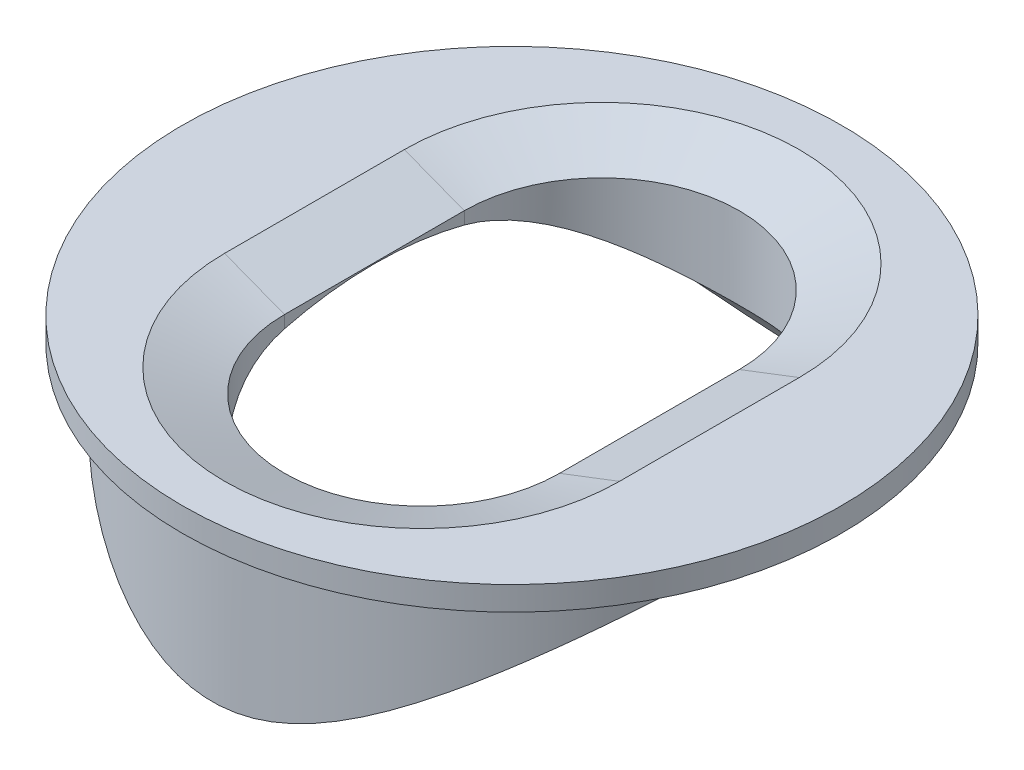
ISO-10303-21;
HEADER;
FILE_DESCRIPTION(('STEP AP214'),'2;1');
FILE_NAME('part.step','',(''),(''),'','','');
FILE_SCHEMA(('AUTOMOTIVE_DESIGN { 1 0 10303 214 1 1 1 1 }'));
ENDSEC;
DATA;
#1=APPLICATION_CONTEXT('core data for automotive mechanical design processes');
#2=APPLICATION_PROTOCOL_DEFINITION('international standard','automotive_design',2000,#1);
#3=PRODUCT_CONTEXT('',#1,'mechanical');
#4=PRODUCT('Part','Part','',(#3));
#5=PRODUCT_RELATED_PRODUCT_CATEGORY('part','',(#4));
#6=PRODUCT_DEFINITION_FORMATION('','',#4);
#7=PRODUCT_DEFINITION_CONTEXT('part definition',#1,'design');
#8=PRODUCT_DEFINITION('design','',#6,#7);
#9=PRODUCT_DEFINITION_SHAPE('','',#8);
#10=(LENGTH_UNIT() NAMED_UNIT(*) SI_UNIT(.MILLI.,.METRE.));
#11=(NAMED_UNIT(*) PLANE_ANGLE_UNIT() SI_UNIT($,.RADIAN.));
#12=(NAMED_UNIT(*) SI_UNIT($,.STERADIAN.) SOLID_ANGLE_UNIT());
#13=UNCERTAINTY_MEASURE_WITH_UNIT(LENGTH_MEASURE(1.E-05),#10,'distance_accuracy_value','');
#14=(GEOMETRIC_REPRESENTATION_CONTEXT(3) GLOBAL_UNCERTAINTY_ASSIGNED_CONTEXT((#13)) GLOBAL_UNIT_ASSIGNED_CONTEXT((#10,
#11,#12)) REPRESENTATION_CONTEXT('',''));
#15=CARTESIAN_POINT('',(0.,0.,0.));
#16=DIRECTION('',(0.,0.,1.));
#17=DIRECTION('',(1.,0.,0.));
#18=AXIS2_PLACEMENT_3D('',#15,#16,#17);
#19=CARTESIAN_POINT('',(0.,5.,0.));
#20=DIRECTION('',(0.,-1.,0.));
#21=DIRECTION('',(0.,0.,-1.));
#22=AXIS2_PLACEMENT_3D('',#19,#20,#21);
#23=CYLINDRICAL_SURFACE('',#22,5.);
#24=CARTESIAN_POINT('',(0.,5.,0.));
#25=DIRECTION('',(0.,1.,0.));
#26=DIRECTION('',(0.,0.,1.));
#27=AXIS2_PLACEMENT_3D('',#24,#25,#26);
#28=CIRCLE('',#27,5.);
#29=CARTESIAN_POINT('',(5.,5.,0.));
#30=VERTEX_POINT('',#29);
#31=CARTESIAN_POINT('',(-5.00000000000002,5.00000000000002,0.));
#32=VERTEX_POINT('',#31);
#33=EDGE_CURVE('E104',#30,#32,#28,.T.);
#34=ORIENTED_EDGE('',*,*,#33,.F.);
#35=CARTESIAN_POINT('',(5.,5.,0.));
#36=CARTESIAN_POINT('',(5.0000064862677,5.00000636279643,-0.118803401095405));
#37=CARTESIAN_POINT('',(4.99576243276274,4.9964675633917,-0.237558182871218));
#38=CARTESIAN_POINT('',(4.97888342242901,4.98241218121961,-0.474087838067091));
#39=CARTESIAN_POINT('',(4.96624750352265,4.97189479839916,-0.591862597565708));
#40=CARTESIAN_POINT('',(4.93280067838579,4.94410935213455,-0.825474733693953));
#41=CARTESIAN_POINT('',(4.9119867768663,4.92683881527392,-0.941311384241482));
#42=CARTESIAN_POINT('',(4.86255145148515,4.88593383048318,-1.17018155731566));
#43=CARTESIAN_POINT('',(4.83392655878944,4.86229655516696,-1.28321381003106));
#44=CARTESIAN_POINT('',(4.73740362240781,4.78287450226039,-1.61550772291657));
#45=CARTESIAN_POINT('',(4.65860789353558,4.71836951829061,-1.82964493287683));
#46=CARTESIAN_POINT('',(4.47594785576944,4.57056793109677,-2.23973970904936));
#47=CARTESIAN_POINT('',(4.37207507698347,4.48726497939233,-2.43569110189251));
#48=CARTESIAN_POINT('',(4.17931765246547,4.33520303254702,-2.7487493551036));
#49=CARTESIAN_POINT('',(4.09605321766379,4.27015451867263,-2.87121824175386));
#50=CARTESIAN_POINT('',(3.92057491487891,4.13495608214751,-3.10654667374618));
#51=CARTESIAN_POINT('',(3.82836116355909,4.06480622600091,-3.21940634431806));
#52=CARTESIAN_POINT('',(3.63553308278675,3.92066908923446,-3.43568816068562));
#53=CARTESIAN_POINT('',(3.53489678957743,3.84667197890407,-3.53908406033977));
#54=CARTESIAN_POINT('',(3.32600704379389,3.69649318853079,-3.73607907111508));
#55=CARTESIAN_POINT('',(3.21775455132494,3.62031178455679,-3.82967941338621));
#56=CARTESIAN_POINT('',(2.99186847524311,3.46590940619064,-4.00872533168449));
#57=CARTESIAN_POINT('',(2.87409893732901,3.38767669457347,-4.09398918746846));
#58=CARTESIAN_POINT('',(2.63097870098595,3.23240914046916,-4.25431125048952));
#59=CARTESIAN_POINT('',(2.50562548412932,3.15537470670733,-4.32936604026974));
#60=CARTESIAN_POINT('',(2.24746866950541,3.0050115613057,-4.46882104937819));
#61=CARTESIAN_POINT('',(2.11468364253878,2.93167441297209,-4.53324636625595));
#62=CARTESIAN_POINT('',(1.84110422364287,2.79155403229088,-4.65107409789267));
#63=CARTESIAN_POINT('',(1.70031678782893,2.72476524134072,-4.70448590476211));
#64=CARTESIAN_POINT('',(1.39667622874439,2.59583630496641,-4.8038705578035));
#65=CARTESIAN_POINT('',(1.23299156369287,2.53471789619366,-4.8486776643058));
#66=CARTESIAN_POINT('',(0.896180811817696,2.43187191424553,-4.92202476595886));
#67=CARTESIAN_POINT('',(0.723078773763431,2.39009732197607,-4.95060424437364));
#68=CARTESIAN_POINT('',(0.457661896369308,2.34688431376343,-4.97982440219376));
#69=CARTESIAN_POINT('',(0.367618679010188,2.33571370000033,-4.98729261982802));
#70=CARTESIAN_POINT('',(0.186635888055952,2.3206515347262,-4.99733565959028));
#71=CARTESIAN_POINT('',(0.095696399075067,2.31675930257913,-4.99991093928053));
#72=CARTESIAN_POINT('',(-0.0861953552895069,2.31649708247112,-5.00008454722765));
#73=CARTESIAN_POINT('',(-0.177147620700307,2.32012711072076,-4.99768286475912));
#74=CARTESIAN_POINT('',(-0.358199787378119,2.33469045716225,-4.98797701095387));
#75=CARTESIAN_POINT('',(-0.448299583463619,2.34562466496004,-4.9806722424497));
#76=CARTESIAN_POINT('',(-0.634290345987522,2.37538324774709,-4.9605577711742));
#77=CARTESIAN_POINT('',(-0.730044329719768,2.3947851529219,-4.94734291419499));
#78=CARTESIAN_POINT('',(-0.919072038911221,2.44038747060614,-4.9157405398429));
#79=CARTESIAN_POINT('',(-1.01234395824117,2.46659269219059,-4.89734936269663));
#80=CARTESIAN_POINT('',(-1.28826795172829,2.55374344299518,-4.83487145070514));
#81=CARTESIAN_POINT('',(-1.46664526370663,2.62315426397916,-4.78352415648848));
#82=CARTESIAN_POINT('',(-1.77568076874676,2.76004871810486,-4.67632227850057));
#83=CARTESIAN_POINT('',(-1.90862269999419,2.82500795712383,-4.62355194613133));
#84=CARTESIAN_POINT('',(-2.16730339944136,2.96043831206373,-4.50808681272012));
#85=CARTESIAN_POINT('',(-2.29303788433664,3.03091264789804,-4.44538619181528));
#86=CARTESIAN_POINT('',(-2.53766285158917,3.17491879023624,-4.31043075762212));
#87=CARTESIAN_POINT('',(-2.65654383781025,3.24845460689311,-4.23816312441515));
#88=CARTESIAN_POINT('',(-2.88743564285202,3.39652708661221,-4.08435401417139));
#89=CARTESIAN_POINT('',(-2.99944783455588,3.47106354601934,-4.00281439970954));
#90=CARTESIAN_POINT('',(-3.22226109628928,3.62342077684068,-3.82600354374306));
#91=CARTESIAN_POINT('',(-3.33269201981388,3.70120929265264,-3.73023700414124));
#92=CARTESIAN_POINT('',(-3.54559939981486,3.85446404087318,-3.52848927170201));
#93=CARTESIAN_POINT('',(-3.64807467199064,3.92992992652313,-3.42250656330085));
#94=CARTESIAN_POINT('',(-3.84425294796649,4.07681645366273,-3.20056123189973));
#95=CARTESIAN_POINT('',(-3.93797365950211,4.14824514018382,-3.08461970676717));
#96=CARTESIAN_POINT('',(-4.11599426421235,4.28566109460446,-2.84274064052496));
#97=CARTESIAN_POINT('',(-4.20029381312783,4.35164816363854,-2.71680273442447));
#98=CARTESIAN_POINT('',(-4.39878554184217,4.50853314592501,-2.38827463214803));
#99=CARTESIAN_POINT('',(-4.50631929530225,4.59498946786027,-2.17932731194452));
#100=CARTESIAN_POINT('',(-4.64613821914312,4.7084038705407,-1.8513717036081));
#101=CARTESIAN_POINT('',(-4.68917312218695,4.74350440601256,-1.73959798407546));
#102=CARTESIAN_POINT('',(-4.76751793421716,4.80764297166477,-1.51170856686385));
#103=CARTESIAN_POINT('',(-4.80283171060456,4.83668403661189,-1.39559507719868));
#104=CARTESIAN_POINT('',(-4.86543453319277,4.88830518104936,-1.15874024023432));
#105=CARTESIAN_POINT('',(-4.89265476556204,4.91082981449133,-1.03796855116843));
#106=CARTESIAN_POINT('',(-4.93816722227972,4.94855722519953,-0.793680719841944));
#107=CARTESIAN_POINT('',(-4.9564638664516,4.96376362711192,-0.670165967971713));
#108=CARTESIAN_POINT('',(-4.98377697031546,4.98648272603519,-0.421443909131275));
#109=CARTESIAN_POINT('',(-4.99279601788868,4.99399756851713,-0.296237084023912));
#110=CARTESIAN_POINT('',(-5.00137053830483,5.00114166173048,-0.0452813606587532));
#111=CARTESIAN_POINT('',(-5.00092704086014,5.00077177047715,0.0804674771283918));
#112=CARTESIAN_POINT('',(-4.9912131909085,4.99267919208227,0.316217699577991));
#113=CARTESIAN_POINT('',(-4.98300958868131,4.98584511760915,0.426296149457824));
#114=CARTESIAN_POINT('',(-4.95942180024422,4.96622340308935,0.645178571447259));
#115=CARTESIAN_POINT('',(-4.94403538382096,4.95343391393135,0.753982136950653));
#116=CARTESIAN_POINT('',(-4.90632392627914,4.922153588973,0.969508932578345));
#117=CARTESIAN_POINT('',(-4.88400108118507,4.90366455762227,1.07623280976896));
#118=CARTESIAN_POINT('',(-4.83274114539643,4.86132925877314,1.28701083316512));
#119=CARTESIAN_POINT('',(-4.80380153552005,4.83748095091222,1.39106394571243));
#120=CARTESIAN_POINT('',(-4.70677908129298,4.75780997966539,1.70100357204864));
#121=CARTESIAN_POINT('',(-4.62897463511253,4.69426548906173,1.90197317990273));
#122=CARTESIAN_POINT('',(-4.45119251532421,4.55070829820292,2.28736622034062));
#123=CARTESIAN_POINT('',(-4.35120664535608,4.47068951124314,2.47178350112441));
#124=CARTESIAN_POINT('',(-4.16241303362757,4.32196402989804,2.77431022087587));
#125=CARTESIAN_POINT('',(-4.07807881363138,4.25618753965956,2.89671891082123));
#126=CARTESIAN_POINT('',(-3.90043631108394,4.11958730343164,3.13182124456801));
#127=CARTESIAN_POINT('',(-3.8071276888363,4.04876336641404,3.24451452031805));
#128=CARTESIAN_POINT('',(-3.61204642318573,3.90332909910819,3.46039828484842));
#129=CARTESIAN_POINT('',(-3.51024916115611,3.82870801884464,3.5635591655786));
#130=CARTESIAN_POINT('',(-3.29899388009149,3.67738428016308,3.75997885952875));
#131=CARTESIAN_POINT('',(-3.18953694443025,3.60068191705467,3.85323906840847));
#132=CARTESIAN_POINT('',(-2.96121350414877,3.44540721169772,4.03144708201688));
#133=CARTESIAN_POINT('',(-2.84221365304651,3.3668259708409,4.11621624228699));
#134=CARTESIAN_POINT('',(-2.59654816531046,3.21106013919063,4.27543853436326));
#135=CARTESIAN_POINT('',(-2.46987979366073,3.13387605960317,4.34988795406829));
#136=CARTESIAN_POINT('',(-2.20902653418021,2.98352281099523,4.48797579821677));
#137=CARTESIAN_POINT('',(-2.07486275313425,2.91034341321279,4.55164272839413));
#138=CARTESIAN_POINT('',(-1.79841659242433,2.77095158572992,4.66777738062599));
#139=CARTESIAN_POINT('',(-1.65614180525609,2.70473280033071,4.72025536508449));
#140=CARTESIAN_POINT('',(-1.35146946258281,2.57850891369613,4.81674752553354));
#141=CARTESIAN_POINT('',(-1.18836978046224,2.51940536010279,4.85976816309609));
#142=CARTESIAN_POINT('',(-0.853057506761583,2.42087013106355,4.92964324178358));
#143=CARTESIAN_POINT('',(-0.680868858020006,2.38138936984465,4.95653805629938));
#144=CARTESIAN_POINT('',(-0.417267118823405,2.34161185607347,4.98335884043903));
#145=CARTESIAN_POINT('',(-0.327939885729355,2.33159299706687,4.9900439743412));
#146=CARTESIAN_POINT('',(-0.148522532583938,2.31874657694375,4.99859875462369));
#147=CARTESIAN_POINT('',(-0.058432477219266,2.31591841207014,5.00046880529626));
#148=CARTESIAN_POINT('',(0.121644228189409,2.31763235091844,4.99933140644563));
#149=CARTESIAN_POINT('',(0.211630875727309,2.32217462964556,4.99632384110741));
#150=CARTESIAN_POINT('',(0.390705731690935,2.33836659549378,4.98551920595953));
#151=CARTESIAN_POINT('',(0.479793444537635,2.3500200062847,4.97771962684741));
#152=CARTESIAN_POINT('',(0.665670000297211,2.38139896959306,4.95646386284238));
#153=CARTESIAN_POINT('',(0.762277582327926,2.40184751901396,4.94249693749092));
#154=CARTESIAN_POINT('',(0.952897655384549,2.44956299936088,4.90931375512976));
#155=CARTESIAN_POINT('',(1.0469082017716,2.47683489368278,4.89009367595844));
#156=CARTESIAN_POINT('',(1.32490519247802,2.56715037769762,4.82502893529808));
#157=CARTESIAN_POINT('',(1.50447425917309,2.6386203494625,4.77182601328659));
#158=CARTESIAN_POINT('',(1.81560530153227,2.77905708413608,4.66101333620414));
#159=CARTESIAN_POINT('',(1.94948557461559,2.84555788327452,4.60651894445034));
#160=CARTESIAN_POINT('',(2.2098947178368,2.98390215298828,4.48741065580201));
#161=CARTESIAN_POINT('',(2.33641925480245,3.05574871700043,4.42279087534715));
#162=CARTESIAN_POINT('',(2.5824750393764,3.20230923095867,4.28378589016389));
#163=CARTESIAN_POINT('',(2.70199665984665,3.27702690475068,4.20938767793865));
#164=CARTESIAN_POINT('',(2.93399936330057,3.42725084654705,4.05109347216149));
#165=CARTESIAN_POINT('',(3.0464818589428,3.50275695275141,3.96719939385687));
#166=CARTESIAN_POINT('',(3.26970299172246,3.65661946215908,3.7855972859226));
#167=CARTESIAN_POINT('',(3.38008420704471,3.73493356113398,3.6874129720634));
#168=CARTESIAN_POINT('',(3.59266286414693,3.88895347699911,3.48062708656673));
#169=CARTESIAN_POINT('',(3.69485901563602,3.96465888158806,3.37202387840541));
#170=CARTESIAN_POINT('',(3.89018127821457,4.11169145947056,3.14465963115798));
#171=CARTESIAN_POINT('',(3.98332637820863,4.1830276775675,3.02592088507467));
#172=CARTESIAN_POINT('',(4.15984718243081,4.31988980472138,2.77827797167402));
#173=CARTESIAN_POINT('',(4.24322187964873,4.38541511469401,2.64937275881185));
#174=CARTESIAN_POINT('',(4.43658392581488,4.53880075702302,2.31715775505749));
#175=CARTESIAN_POINT('',(4.54010823809411,4.62226392609454,2.1078590133521));
#176=CARTESIAN_POINT('',(4.67390583373137,4.73103285742108,1.78004652854697));
#177=CARTESIAN_POINT('',(4.71491832045558,4.7645471565668,1.66848545194811));
#178=CARTESIAN_POINT('',(4.78927419077675,4.82552080229896,1.44122911865483));
#179=CARTESIAN_POINT('',(4.8226186393853,4.85298098971731,1.3255344386574));
#180=CARTESIAN_POINT('',(4.90034346391484,4.91714489125081,1.01333234603958));
#181=CARTESIAN_POINT('',(4.93754678243697,4.94804013902009,0.813745597053209));
#182=CARTESIAN_POINT('',(4.98736819813601,4.98946116455115,0.409390797411382));
#183=CARTESIAN_POINT('',(4.99998882825427,4.99998904091734,0.204623282772272));
#184=CARTESIAN_POINT('',(5.,5.,0.));
#185=B_SPLINE_CURVE_WITH_KNOTS('',3,(#35,#36,#37,#38,#39,#40,#41,#42,#43,#44,#45,#46,#47,#48,
#49,#50,#51,#52,#53,#54,#55,#56,#57,#58,#59,#60,#61,#62,#63,#64,#65,#66,#67,#68,#69,#70,#71,#72,
#73,#74,#75,#76,#77,#78,#79,#80,#81,#82,#83,#84,#85,#86,#87,#88,#89,#90,#91,#92,#93,#94,#95,#96,
#97,#98,#99,#100,#101,#102,#103,#104,#105,#106,#107,#108,#109,#110,#111,#112,#113,#114,#115,
#116,#117,#118,#119,#120,#121,#122,#123,#124,#125,#126,#127,#128,#129,#130,#131,#132,#133,#134,
#135,#136,#137,#138,#139,#140,#141,#142,#143,#144,#145,#146,#147,#148,#149,#150,#151,#152,#153,
#154,#155,#156,#157,#158,#159,#160,#161,#162,#163,#164,#165,#166,#167,#168,#169,#170,#171,#172,
#173,#174,#175,#176,#177,#178,#179,#180,#181,#182,#183,#184),.UNSPECIFIED.,.T.,.F.,(4,2,2,2,2,2,
2,2,2,2,2,2,2,2,2,2,2,2,2,2,2,2,2,2,2,2,2,2,2,2,2,2,2,2,2,2,2,2,2,2,2,2,2,2,2,2,2,2,2,2,2,2,2,2,
2,2,2,2,2,2,2,2,2,2,2,2,2,2,2,2,2,2,2,2,4),(0.,0.356198531128419,0.712437905356867,
1.06880787854775,1.42533637270188,2.13333209783898,2.84156728725027,3.32622201622343,
3.81087042808177,4.29682459639559,4.78271761425373,5.27755036039961,5.77254834493272,
6.26636031071477,6.75974940543413,7.29936255278482,7.83765708456692,8.11040822806103,
8.38313386402394,8.65586008771504,8.92861953390792,9.22392701856221,9.51944381892724,
10.1116379066242,10.5823769120489,11.0533928323055,11.5250464324407,11.9966054526408,
12.4928422896337,12.9891528567514,13.484436760364,13.9797387562551,14.7274446962693,
15.1015034988401,15.4753745093337,15.8523389140401,16.2291164194433,16.6057887984766,
16.9824201883012,17.3138076935885,17.6452981608744,17.9766837873554,18.3081957920453,
18.9794342536,19.6509211619365,20.1379627282136,20.6250227371037,21.1135480143903,
21.6020043344423,22.0992028034935,22.5965796576366,23.0926203414622,23.5882040850607,
24.1228614856737,24.6561746412001,24.9262177314022,25.196238147046,25.4662649741992,
25.7364333195518,26.0351569724179,26.3340985560114,26.9331443359533,27.4099325615984,
27.8869988690867,28.3647063284082,28.8423176087132,29.3434029116174,29.844567050611,
30.3446559675372,30.8447963820892,31.5852621624669,31.9553671316834,32.325420666041,
32.9389891607904,33.5524944315665),.UNSPECIFIED.);
#186=EDGE_CURVE('E116',#30,#32,#185,.T.);
#187=ORIENTED_EDGE('',*,*,#186,.T.);
#188=EDGE_LOOP('',(#34,#187));
#189=FACE_BOUND('',#188,.T.);
#190=ADVANCED_FACE('F33',(#189),#23,.T.);
#191=EDGE_CURVE('E123',#32,#30,#28,.T.);
#192=ORIENTED_EDGE('',*,*,#191,.F.);
#193=EDGE_CURVE('E174',#32,#30,#185,.T.);
#194=ORIENTED_EDGE('',*,*,#193,.T.);
#195=EDGE_LOOP('',(#192,#194));
#196=FACE_BOUND('',#195,.T.);
#197=ADVANCED_FACE('F186',(#196),#23,.T.);
#198=CARTESIAN_POINT('',(0.,5.,0.));
#199=DIRECTION('',(0.,1.,0.));
#200=DIRECTION('',(0.,0.,1.));
#201=AXIS2_PLACEMENT_3D('',#198,#199,#200);
#202=PLANE('',#201);
#203=ORIENTED_EDGE('',*,*,#33,.T.);
#204=ORIENTED_EDGE('',*,*,#191,.T.);
#205=EDGE_LOOP('',(#203,#204));
#206=FACE_BOUND('',#205,.T.);
#207=CARTESIAN_POINT('',(0.,5.,0.));
#208=DIRECTION('',(0.,1.,0.));
#209=DIRECTION('',(0.,0.,1.));
#210=AXIS2_PLACEMENT_3D('',#207,#208,#209);
#211=CIRCLE('',#210,5.5);
#212=CARTESIAN_POINT('',(0.,5.,5.5));
#213=VERTEX_POINT('',#212);
#214=EDGE_CURVE('E124',#213,#213,#211,.T.);
#215=ORIENTED_EDGE('',*,*,#214,.F.);
#216=EDGE_LOOP('',(#215));
#217=FACE_BOUND('',#216,.T.);
#218=ADVANCED_FACE('F210',(#206,#217),#202,.F.);
#219=CARTESIAN_POINT('',(0.,5.4,0.));
#220=DIRECTION('',(0.,-1.,0.));
#221=DIRECTION('',(0.,0.,-1.));
#222=AXIS2_PLACEMENT_3D('',#219,#220,#221);
#223=CYLINDRICAL_SURFACE('',#222,5.5);
#224=CARTESIAN_POINT('',(0.,5.4,0.));
#225=DIRECTION('',(0.,1.,0.));
#226=DIRECTION('',(0.,0.,1.));
#227=AXIS2_PLACEMENT_3D('',#224,#225,#226);
#228=CIRCLE('',#227,5.5);
#229=CARTESIAN_POINT('',(0.,5.4,5.5));
#230=VERTEX_POINT('',#229);
#231=EDGE_CURVE('E120',#230,#230,#228,.T.);
#232=ORIENTED_EDGE('',*,*,#231,.F.);
#233=EDGE_LOOP('',(#232));
#234=FACE_BOUND('',#233,.T.);
#235=ORIENTED_EDGE('',*,*,#214,.T.);
#236=EDGE_LOOP('',(#235));
#237=FACE_BOUND('',#236,.T.);
#238=ADVANCED_FACE('F209',(#234,#237),#223,.T.);
#239=CARTESIAN_POINT('',(0.,5.4,0.));
#240=DIRECTION('',(0.,1.,0.));
#241=DIRECTION('',(0.,0.,1.));
#242=AXIS2_PLACEMENT_3D('',#239,#240,#241);
#243=PLANE('',#242);
#244=DIRECTION('',(0.,0.,-1.));
#245=VECTOR('',#244,1.);
#246=CARTESIAN_POINT('',(-3.29525037907765,5.4,-1.5));
#247=LINE('',#246,#245);
#248=CARTESIAN_POINT('',(-3.29525037907765,5.4,1.5));
#249=VERTEX_POINT('',#248);
#250=CARTESIAN_POINT('',(-3.29525037907765,5.4,-1.5));
#251=VERTEX_POINT('',#250);
#252=EDGE_CURVE('E135',#249,#251,#247,.T.);
#253=ORIENTED_EDGE('',*,*,#252,.T.);
#254=CARTESIAN_POINT('',(0.,5.4,-1.5));
#255=DIRECTION('',(0.,1.,0.));
#256=DIRECTION('',(0.,0.,1.));
#257=AXIS2_PLACEMENT_3D('',#254,#255,#256);
#258=CIRCLE('',#257,3.29525037907765);
#259=CARTESIAN_POINT('',(3.29525037907765,5.4,-1.5));
#260=VERTEX_POINT('',#259);
#261=EDGE_CURVE('E137',#251,#260,#258,.F.);
#262=ORIENTED_EDGE('',*,*,#261,.T.);
#263=DIRECTION('',(0.,0.,1.));
#264=VECTOR('',#263,1.);
#265=CARTESIAN_POINT('',(3.29525037907765,5.4,1.5));
#266=LINE('',#265,#264);
#267=CARTESIAN_POINT('',(3.29525037907765,5.4,1.5));
#268=VERTEX_POINT('',#267);
#269=EDGE_CURVE('E133',#260,#268,#266,.T.);
#270=ORIENTED_EDGE('',*,*,#269,.T.);
#271=CARTESIAN_POINT('',(0.,5.4,1.5));
#272=DIRECTION('',(0.,1.,0.));
#273=DIRECTION('',(0.,0.,1.));
#274=AXIS2_PLACEMENT_3D('',#271,#272,#273);
#275=CIRCLE('',#274,3.29525037907765);
#276=EDGE_CURVE('E131',#268,#249,#275,.F.);
#277=ORIENTED_EDGE('',*,*,#276,.T.);
#278=EDGE_LOOP('',(#253,#262,#270,#277));
#279=FACE_BOUND('',#278,.T.);
#280=ORIENTED_EDGE('',*,*,#231,.T.);
#281=EDGE_LOOP('',(#280));
#282=FACE_BOUND('',#281,.T.);
#283=ADVANCED_FACE('F160',(#279,#282),#243,.T.);
#284=CARTESIAN_POINT('',(0.,0.,-1.5));
#285=DIRECTION('',(0.,1.,0.));
#286=DIRECTION('',(0.,0.,1.));
#287=AXIS2_PLACEMENT_3D('',#284,#285,#286);
#288=CYLINDRICAL_SURFACE('',#287,2.29525037907763);
#289=DIRECTION('',(0.,1.,0.));
#290=VECTOR('',#289,1.);
#291=CARTESIAN_POINT('',(2.29525037907763,0.,-1.5));
#292=LINE('',#291,#290);
#293=CARTESIAN_POINT('',(2.29525037907763,4.80947501931113,-1.5));
#294=VERTEX_POINT('',#293);
#295=CARTESIAN_POINT('',(2.29525037907763,5.01613596496458,-1.5));
#296=VERTEX_POINT('',#295);
#297=EDGE_CURVE('E114',#294,#296,#292,.T.);
#298=ORIENTED_EDGE('',*,*,#297,.T.);
#299=CARTESIAN_POINT('',(0.,5.01613596496458,-1.5));
#300=DIRECTION('',(0.,1.,0.));
#301=DIRECTION('',(0.,0.,1.));
#302=AXIS2_PLACEMENT_3D('',#299,#300,#301);
#303=CIRCLE('',#302,2.29525037907763);
#304=CARTESIAN_POINT('',(-2.29525037907763,5.01613596496458,-1.5));
#305=VERTEX_POINT('',#304);
#306=EDGE_CURVE('E103',#296,#305,#303,.T.);
#307=ORIENTED_EDGE('',*,*,#306,.T.);
#308=DIRECTION('',(0.,1.,0.));
#309=VECTOR('',#308,1.);
#310=CARTESIAN_POINT('',(-2.29525037907763,0.,-1.5));
#311=LINE('',#310,#309);
#312=CARTESIAN_POINT('',(-2.29525037907763,4.80947501931113,-1.5));
#313=VERTEX_POINT('',#312);
#314=EDGE_CURVE('E112',#313,#305,#311,.T.);
#315=ORIENTED_EDGE('',*,*,#314,.F.);
#316=CARTESIAN_POINT('',(-2.29525037907763,4.80947501931113,-1.5));
#317=CARTESIAN_POINT('',(-2.29525756117897,4.79216943666611,-1.56706870523049));
#318=CARTESIAN_POINT('',(-2.29231125221883,4.77368627245705,-1.63381280633951));
#319=CARTESIAN_POINT('',(-2.28073423681691,4.73458929481462,-1.76612741640136));
#320=CARTESIAN_POINT('',(-2.27210741739109,4.71397694644894,-1.83169869639076));
#321=CARTESIAN_POINT('',(-2.24944669337928,4.67092696848744,-1.96092083119155));
#322=CARTESIAN_POINT('',(-2.23543932804101,4.6484987176624,-2.02457948382594));
#323=CARTESIAN_POINT('',(-2.20227028880376,4.6019954806311,-2.14991213750758));
#324=CARTESIAN_POINT('',(-2.18310780016612,4.57792023457526,-2.21158582311525));
#325=CARTESIAN_POINT('',(-2.11837550360657,4.50377414317691,-2.39278329338229));
#326=CARTESIAN_POINT('',(-2.06547974383908,4.45163159344131,-2.50893138624011));
#327=CARTESIAN_POINT('',(-1.94197426450413,4.34434633977588,-2.73004377116025));
#328=CARTESIAN_POINT('',(-1.87133140099418,4.28919817526171,-2.83498660815289));
#329=CARTESIAN_POINT('',(-1.70688356129,4.17393552292586,-3.04063494397144));
#330=CARTESIAN_POINT('',(-1.61158320892234,4.11381292070827,-3.14014601850042));
#331=CARTESIAN_POINT('',(-1.4032613265497,3.99788096813652,-3.3215601612981));
#332=CARTESIAN_POINT('',(-1.29025583764929,3.94206778106477,-3.40347901063474));
#333=CARTESIAN_POINT('',(-1.07384589514597,3.85106293145875,-3.53157178849191));
#334=CARTESIAN_POINT('',(-0.973534627180665,3.81401199842372,-3.5816430492916));
#335=CARTESIAN_POINT('',(-0.764108636516284,3.74910499525985,-3.66727365528827));
#336=CARTESIAN_POINT('',(-0.655003453264526,3.72123912408997,-3.70284847874213));
#337=CARTESIAN_POINT('',(-0.429277591920363,3.67766050951745,-3.75776050014919));
#338=CARTESIAN_POINT('',(-0.312599355061834,3.66205658138367,-3.77695243913229));
#339=CARTESIAN_POINT('',(-0.076666780882392,3.64573757600813,-3.79701401710469));
#340=CARTESIAN_POINT('',(0.0425853212511539,3.64501006247763,-3.79789896026504));
#341=CARTESIAN_POINT('',(0.262508826241921,3.65756321102131,-3.78247992037646));
#342=CARTESIAN_POINT('',(0.363472600736779,3.66892389878316,-3.76853201637913));
#343=CARTESIAN_POINT('',(0.561153008821979,3.70144077228381,-3.7278848567597));
#344=CARTESIAN_POINT('',(0.657867818883834,3.72260111963771,-3.70118018357684));
#345=CARTESIAN_POINT('',(0.848849500879238,3.7737331215167,-3.63500666209038));
#346=CARTESIAN_POINT('',(0.942868833389495,3.80401976943829,-3.59507535125195));
#347=CARTESIAN_POINT('',(1.12308813055019,3.87066326103045,-3.50425618484275));
#348=CARTESIAN_POINT('',(1.20928518786145,3.9070223475252,-3.45336427901387));
#349=CARTESIAN_POINT('',(1.38974986456147,3.99138640585682,-3.33056413834221));
#350=CARTESIAN_POINT('',(1.48213595643693,4.04026086395589,-3.25648729260732));
#351=CARTESIAN_POINT('',(1.65387824607878,4.14050097958669,-3.09584207255562));
#352=CARTESIAN_POINT('',(1.73321906621849,4.19186948602701,-3.00925917880406));
#353=CARTESIAN_POINT('',(1.89023729911333,4.30317508382529,-2.80919035364145));
#354=CARTESIAN_POINT('',(1.96532357492268,4.36307949062689,-2.69363453833082));
#355=CARTESIAN_POINT('',(2.09417371766223,4.47886679005678,-2.44953578014428));
#356=CARTESIAN_POINT('',(2.14796679970723,4.53475510609003,-2.32101093746589));
#357=CARTESIAN_POINT('',(2.22414305635667,4.62978281792166,-2.07828348465601));
#358=CARTESIAN_POINT('',(2.25048442427415,4.67011186385479,-1.96579688937876));
#359=CARTESIAN_POINT('',(2.27715494282705,4.72599901454957,-1.79349099158604));
#360=CARTESIAN_POINT('',(2.28390530619047,4.74388429472149,-1.73536744169404));
#361=CARTESIAN_POINT('',(2.29295509046322,4.77797502665553,-1.6182511699115));
#362=CARTESIAN_POINT('',(2.29525186849171,4.79417947557111,-1.55925795284396));
#363=CARTESIAN_POINT('',(2.29525037907763,4.80947501931113,-1.5));
#364=B_SPLINE_CURVE_WITH_KNOTS('',3,(#316,#317,#318,#319,#320,#321,#322,#323,#324,#325,#326,
#327,#328,#329,#330,#331,#332,#333,#334,#335,#336,#337,#338,#339,#340,#341,#342,#343,#344,#345,
#346,#347,#348,#349,#350,#351,#352,#353,#354,#355,#356,#357,#358,#359,#360,#361,#362,#363),
.UNSPECIFIED.,.F.,.F.,(4,2,2,2,2,2,2,2,2,2,2,2,2,2,2,2,2,2,2,2,2,2,2,4),(0.,0.207692676264016,
0.415243381664593,0.621783234183211,0.828355748376737,1.24007894178027,1.6525768483269,
2.1015352531209,2.55008922270512,2.90297025365333,3.25547350999001,3.61107070410262,
3.96637061621147,4.27262110579314,4.57900176999894,4.89748284816239,5.21608181687993,
5.59897338362119,5.98231311222865,6.43102652570002,6.8791221345173,7.24476857842712,
7.42815732359866,7.61165486346317),.UNSPECIFIED.);
#365=EDGE_CURVE('E101',#313,#294,#364,.T.);
#366=ORIENTED_EDGE('',*,*,#365,.T.);
#367=EDGE_LOOP('',(#298,#307,#315,#366));
#368=FACE_BOUND('',#367,.T.);
#369=ADVANCED_FACE('F170',(#368),#288,.F.);
#370=CARTESIAN_POINT('',(2.29525037907763,0.,-1.5));
#371=DIRECTION('',(1.,0.,0.));
#372=DIRECTION('',(0.,0.,-1.));
#373=AXIS2_PLACEMENT_3D('',#370,#371,#372);
#374=PLANE('',#373);
#375=DIRECTION('',(0.,1.,0.));
#376=VECTOR('',#375,1.);
#377=CARTESIAN_POINT('',(2.29525037907763,0.,1.5));
#378=LINE('',#377,#376);
#379=CARTESIAN_POINT('',(2.29525037907763,4.80947501931113,1.5));
#380=VERTEX_POINT('',#379);
#381=CARTESIAN_POINT('',(2.29525037907763,5.01613596496458,1.5));
#382=VERTEX_POINT('',#381);
#383=EDGE_CURVE('E108',#380,#382,#378,.T.);
#384=ORIENTED_EDGE('',*,*,#383,.T.);
#385=DIRECTION('',(0.,0.,-1.));
#386=VECTOR('',#385,1.);
#387=CARTESIAN_POINT('',(2.29525037907763,5.01613596496458,-1.5));
#388=LINE('',#387,#386);
#389=EDGE_CURVE('E42',#382,#296,#388,.T.);
#390=ORIENTED_EDGE('',*,*,#389,.T.);
#391=ORIENTED_EDGE('',*,*,#297,.F.);
#392=CARTESIAN_POINT('',(2.29525037907763,-1.,0.));
#393=DIRECTION('',(1.,0.,0.));
#394=DIRECTION('',(0.,0.,-1.));
#395=AXIS2_PLACEMENT_3D('',#392,#393,#394);
#396=CIRCLE('',#395,6.);
#397=EDGE_CURVE('E109',#294,#380,#396,.T.);
#398=ORIENTED_EDGE('',*,*,#397,.T.);
#399=EDGE_LOOP('',(#384,#390,#391,#398));
#400=FACE_BOUND('',#399,.T.);
#401=ADVANCED_FACE('F193',(#400),#374,.F.);
#402=CARTESIAN_POINT('',(0.,0.,1.5));
#403=DIRECTION('',(0.,1.,0.));
#404=DIRECTION('',(0.,0.,1.));
#405=AXIS2_PLACEMENT_3D('',#402,#403,#404);
#406=CYLINDRICAL_SURFACE('',#405,2.29525037907763);
#407=DIRECTION('',(0.,1.,0.));
#408=VECTOR('',#407,1.);
#409=CARTESIAN_POINT('',(-2.29525037907763,0.,1.5));
#410=LINE('',#409,#408);
#411=CARTESIAN_POINT('',(-2.29525037907763,4.80947501931113,1.5));
#412=VERTEX_POINT('',#411);
#413=CARTESIAN_POINT('',(-2.29525037907763,5.01613596496458,1.5));
#414=VERTEX_POINT('',#413);
#415=EDGE_CURVE('E107',#412,#414,#410,.T.);
#416=ORIENTED_EDGE('',*,*,#415,.T.);
#417=CARTESIAN_POINT('',(0.,5.01613596496458,1.5));
#418=DIRECTION('',(0.,1.,0.));
#419=DIRECTION('',(0.,0.,1.));
#420=AXIS2_PLACEMENT_3D('',#417,#418,#419);
#421=CIRCLE('',#420,2.29525037907763);
#422=EDGE_CURVE('E11',#414,#382,#421,.T.);
#423=ORIENTED_EDGE('',*,*,#422,.T.);
#424=ORIENTED_EDGE('',*,*,#383,.F.);
#425=CARTESIAN_POINT('',(2.29525037907763,4.80947501931113,1.5));
#426=CARTESIAN_POINT('',(2.29525756117897,4.79216943666611,1.56706870523049));
#427=CARTESIAN_POINT('',(2.29231125221883,4.77368627245705,1.63381280633951));
#428=CARTESIAN_POINT('',(2.28073423681691,4.73458929481462,1.76612741640136));
#429=CARTESIAN_POINT('',(2.27210741739109,4.71397694644894,1.83169869639076));
#430=CARTESIAN_POINT('',(2.24944669337928,4.67092696848744,1.96092083119155));
#431=CARTESIAN_POINT('',(2.23543932804101,4.6484987176624,2.02457948382594));
#432=CARTESIAN_POINT('',(2.20227028880376,4.6019954806311,2.14991213750758));
#433=CARTESIAN_POINT('',(2.18310780016612,4.57792023457526,2.21158582311525));
#434=CARTESIAN_POINT('',(2.11837550360657,4.50377414317691,2.39278329338229));
#435=CARTESIAN_POINT('',(2.06547974383908,4.45163159344131,2.50893138624011));
#436=CARTESIAN_POINT('',(1.94197426450413,4.34434633977588,2.73004377116025));
#437=CARTESIAN_POINT('',(1.87133140099418,4.28919817526171,2.83498660815289));
#438=CARTESIAN_POINT('',(1.70688356129,4.17393552292586,3.04063494397144));
#439=CARTESIAN_POINT('',(1.61158320892234,4.11381292070827,3.14014601850042));
#440=CARTESIAN_POINT('',(1.4032613265497,3.99788096813652,3.3215601612981));
#441=CARTESIAN_POINT('',(1.29025583764929,3.94206778106477,3.40347901063474));
#442=CARTESIAN_POINT('',(1.07384589514597,3.85106293145875,3.53157178849191));
#443=CARTESIAN_POINT('',(0.973534627180664,3.81401199842372,3.5816430492916));
#444=CARTESIAN_POINT('',(0.764108636516283,3.74910499525985,3.66727365528827));
#445=CARTESIAN_POINT('',(0.655003453264525,3.72123912408997,3.70284847874213));
#446=CARTESIAN_POINT('',(0.429277591920362,3.67766050951745,3.75776050014919));
#447=CARTESIAN_POINT('',(0.312599355061833,3.66205658138367,3.77695243913229));
#448=CARTESIAN_POINT('',(0.0766667808823914,3.64573757600813,3.79701401710469));
#449=CARTESIAN_POINT('',(-0.0425853212511545,3.64501006247763,3.79789896026504));
#450=CARTESIAN_POINT('',(-0.262508826241922,3.65756321102131,3.78247992037646));
#451=CARTESIAN_POINT('',(-0.363472600736779,3.66892389878316,3.76853201637913));
#452=CARTESIAN_POINT('',(-0.561153008821979,3.70144077228381,3.7278848567597));
#453=CARTESIAN_POINT('',(-0.657867818883834,3.72260111963771,3.70118018357684));
#454=CARTESIAN_POINT('',(-0.848849500879238,3.7737331215167,3.63500666209038));
#455=CARTESIAN_POINT('',(-0.942868833389495,3.80401976943829,3.59507535125195));
#456=CARTESIAN_POINT('',(-1.12308813055019,3.87066326103045,3.50425618484275));
#457=CARTESIAN_POINT('',(-1.20928518786145,3.9070223475252,3.45336427901387));
#458=CARTESIAN_POINT('',(-1.38974986456147,3.99138640585682,3.33056413834221));
#459=CARTESIAN_POINT('',(-1.48213595643693,4.04026086395589,3.25648729260732));
#460=CARTESIAN_POINT('',(-1.65387824607878,4.14050097958669,3.09584207255562));
#461=CARTESIAN_POINT('',(-1.73321906621849,4.19186948602701,3.00925917880406));
#462=CARTESIAN_POINT('',(-1.89023729911333,4.30317508382529,2.80919035364145));
#463=CARTESIAN_POINT('',(-1.96532357492268,4.36307949062689,2.69363453833082));
#464=CARTESIAN_POINT('',(-2.09417371766223,4.47886679005678,2.44953578014427));
#465=CARTESIAN_POINT('',(-2.14796679970723,4.53475510609003,2.32101093746589));
#466=CARTESIAN_POINT('',(-2.22414305635667,4.62978281792166,2.07828348465601));
#467=CARTESIAN_POINT('',(-2.25048442427415,4.67011186385479,1.96579688937876));
#468=CARTESIAN_POINT('',(-2.27715494282705,4.72599901454957,1.79349099158604));
#469=CARTESIAN_POINT('',(-2.28390530619047,4.74388429472149,1.73536744169404));
#470=CARTESIAN_POINT('',(-2.29295509046322,4.77797502665553,1.6182511699115));
#471=CARTESIAN_POINT('',(-2.29525186849171,4.79417947557111,1.55925795284395));
#472=CARTESIAN_POINT('',(-2.29525037907763,4.80947501931113,1.5));
#473=B_SPLINE_CURVE_WITH_KNOTS('',3,(#425,#426,#427,#428,#429,#430,#431,#432,#433,#434,#435,
#436,#437,#438,#439,#440,#441,#442,#443,#444,#445,#446,#447,#448,#449,#450,#451,#452,#453,#454,
#455,#456,#457,#458,#459,#460,#461,#462,#463,#464,#465,#466,#467,#468,#469,#470,#471,#472),
.UNSPECIFIED.,.F.,.F.,(4,2,2,2,2,2,2,2,2,2,2,2,2,2,2,2,2,2,2,2,2,2,2,4),(0.,0.207692676264016,
0.415243381664593,0.621783234183211,0.828355748376738,1.24007894178027,1.6525768483269,
2.1015352531209,2.55008922270512,2.90297025365333,3.25547350999001,3.61107070410262,
3.96637061621147,4.27262110579314,4.57900176999894,4.89748284816239,5.21608181687993,
5.59897338362119,5.98231311222865,6.43102652570002,6.8791221345173,7.24476857842713,
7.42815732359866,7.61165486346318),.UNSPECIFIED.);
#474=EDGE_CURVE('E98',#380,#412,#473,.T.);
#475=ORIENTED_EDGE('',*,*,#474,.T.);
#476=EDGE_LOOP('',(#416,#423,#424,#475));
#477=FACE_BOUND('',#476,.T.);
#478=ADVANCED_FACE('F106',(#477),#406,.F.);
#479=CARTESIAN_POINT('',(-2.29525037907763,0.,-1.5));
#480=DIRECTION('',(-1.,0.,0.));
#481=DIRECTION('',(0.,0.,1.));
#482=AXIS2_PLACEMENT_3D('',#479,#480,#481);
#483=PLANE('',#482);
#484=ORIENTED_EDGE('',*,*,#314,.T.);
#485=DIRECTION('',(0.,0.,1.));
#486=VECTOR('',#485,1.);
#487=CARTESIAN_POINT('',(-2.29525037907763,5.01613596496458,1.5));
#488=LINE('',#487,#486);
#489=EDGE_CURVE('E56',#305,#414,#488,.T.);
#490=ORIENTED_EDGE('',*,*,#489,.T.);
#491=ORIENTED_EDGE('',*,*,#415,.F.);
#492=CARTESIAN_POINT('',(-2.29525037907763,-1.,0.));
#493=DIRECTION('',(-1.,0.,0.));
#494=DIRECTION('',(0.,0.,1.));
#495=AXIS2_PLACEMENT_3D('',#492,#493,#494);
#496=CIRCLE('',#495,6.);
#497=EDGE_CURVE('E94',#412,#313,#496,.T.);
#498=ORIENTED_EDGE('',*,*,#497,.T.);
#499=EDGE_LOOP('',(#484,#490,#491,#498));
#500=FACE_BOUND('',#499,.T.);
#501=ADVANCED_FACE('F111',(#500),#483,.F.);
#502=CARTESIAN_POINT('',(-5.5,-1.,0.));
#503=DIRECTION('',(1.,0.,0.));
#504=DIRECTION('',(0.,0.,-1.));
#505=AXIS2_PLACEMENT_3D('',#502,#503,#504);
#506=CYLINDRICAL_SURFACE('',#505,6.);
#507=ORIENTED_EDGE('',*,*,#497,.F.);
#508=ORIENTED_EDGE('',*,*,#474,.F.);
#509=ORIENTED_EDGE('',*,*,#397,.F.);
#510=ORIENTED_EDGE('',*,*,#365,.F.);
#511=EDGE_LOOP('',(#507,#508,#509,#510));
#512=FACE_BOUND('',#511,.T.);
#513=ORIENTED_EDGE('',*,*,#193,.F.);
#514=ORIENTED_EDGE('',*,*,#186,.F.);
#515=EDGE_LOOP('',(#513,#514));
#516=FACE_BOUND('',#515,.T.);
#517=ADVANCED_FACE('F96',(#512,#516),#506,.F.);
#518=CARTESIAN_POINT('',(0.,5.01613596496458,1.5));
#519=DIRECTION('',(0.,1.,0.));
#520=DIRECTION('',(0.,0.,1.));
#521=AXIS2_PLACEMENT_3D('',#518,#519,#520);
#522=CONICAL_SURFACE('',#521,2.29525037907763,1.20427718387609);
#523=DIRECTION('',(0.933580426497203,-0.358367949545298,0.));
#524=VECTOR('',#523,1.);
#525=CARTESIAN_POINT('',(-3.29525037907765,5.4,1.5));
#526=LINE('',#525,#524);
#527=EDGE_CURVE('E145',#249,#414,#526,.T.);
#528=ORIENTED_EDGE('',*,*,#527,.F.);
#529=ORIENTED_EDGE('',*,*,#276,.F.);
#530=DIRECTION('',(0.933580426497203,0.358367949545298,0.));
#531=VECTOR('',#530,1.);
#532=CARTESIAN_POINT('',(2.29525037907763,5.01613596496458,1.5));
#533=LINE('',#532,#531);
#534=EDGE_CURVE('E37',#382,#268,#533,.T.);
#535=ORIENTED_EDGE('',*,*,#534,.F.);
#536=ORIENTED_EDGE('',*,*,#422,.F.);
#537=EDGE_LOOP('',(#528,#529,#535,#536));
#538=FACE_BOUND('',#537,.T.);
#539=ADVANCED_FACE('F35',(#538),#522,.F.);
#540=CARTESIAN_POINT('',(2.29525037907763,5.01613596496458,-1.5));
#541=DIRECTION('',(-0.358367949545297,0.933580426497203,0.));
#542=DIRECTION('',(-0.933580426497203,-0.358367949545297,0.));
#543=AXIS2_PLACEMENT_3D('',#540,#541,#542);
#544=PLANE('',#543);
#545=ORIENTED_EDGE('',*,*,#534,.T.);
#546=ORIENTED_EDGE('',*,*,#269,.F.);
#547=DIRECTION('',(0.933580426497203,0.358367949545297,0.));
#548=VECTOR('',#547,1.);
#549=CARTESIAN_POINT('',(2.29525037907763,5.01613596496458,-1.5));
#550=LINE('',#549,#548);
#551=EDGE_CURVE('E144',#296,#260,#550,.T.);
#552=ORIENTED_EDGE('',*,*,#551,.F.);
#553=ORIENTED_EDGE('',*,*,#389,.F.);
#554=EDGE_LOOP('',(#545,#546,#552,#553));
#555=FACE_BOUND('',#554,.T.);
#556=ADVANCED_FACE('F155',(#555),#544,.T.);
#557=CARTESIAN_POINT('',(-2.29525037907763,5.01613596496458,-1.5));
#558=DIRECTION('',(0.358367949545297,0.933580426497203,0.));
#559=DIRECTION('',(-0.933580426497203,0.358367949545297,0.));
#560=AXIS2_PLACEMENT_3D('',#557,#558,#559);
#561=PLANE('',#560);
#562=ORIENTED_EDGE('',*,*,#527,.T.);
#563=ORIENTED_EDGE('',*,*,#489,.F.);
#564=DIRECTION('',(0.933580426497203,-0.358367949545297,0.));
#565=VECTOR('',#564,1.);
#566=CARTESIAN_POINT('',(-3.29525037907765,5.4,-1.5));
#567=LINE('',#566,#565);
#568=EDGE_CURVE('E142',#251,#305,#567,.T.);
#569=ORIENTED_EDGE('',*,*,#568,.F.);
#570=ORIENTED_EDGE('',*,*,#252,.F.);
#571=EDGE_LOOP('',(#562,#563,#569,#570));
#572=FACE_BOUND('',#571,.T.);
#573=ADVANCED_FACE('F167',(#572),#561,.T.);
#574=CARTESIAN_POINT('',(0.,5.01613596496458,-1.5));
#575=DIRECTION('',(0.,1.,0.));
#576=DIRECTION('',(0.,0.,1.));
#577=AXIS2_PLACEMENT_3D('',#574,#575,#576);
#578=CONICAL_SURFACE('',#577,2.29525037907763,1.20427718387609);
#579=ORIENTED_EDGE('',*,*,#551,.T.);
#580=ORIENTED_EDGE('',*,*,#261,.F.);
#581=ORIENTED_EDGE('',*,*,#568,.T.);
#582=ORIENTED_EDGE('',*,*,#306,.F.);
#583=EDGE_LOOP('',(#579,#580,#581,#582));
#584=FACE_BOUND('',#583,.T.);
#585=ADVANCED_FACE('F165',(#584),#578,.F.);
#586=CLOSED_SHELL('',(#190,#197,#218,#238,#283,#369,#401,#478,#501,#517,#539,#556,#573,#585));
#587=MANIFOLD_SOLID_BREP('B2',#586);
#588=ADVANCED_BREP_SHAPE_REPRESENTATION('',(#18,#587),#14);
#589=SHAPE_DEFINITION_REPRESENTATION(#9,#588);
ENDSEC;
END-ISO-10303-21;
